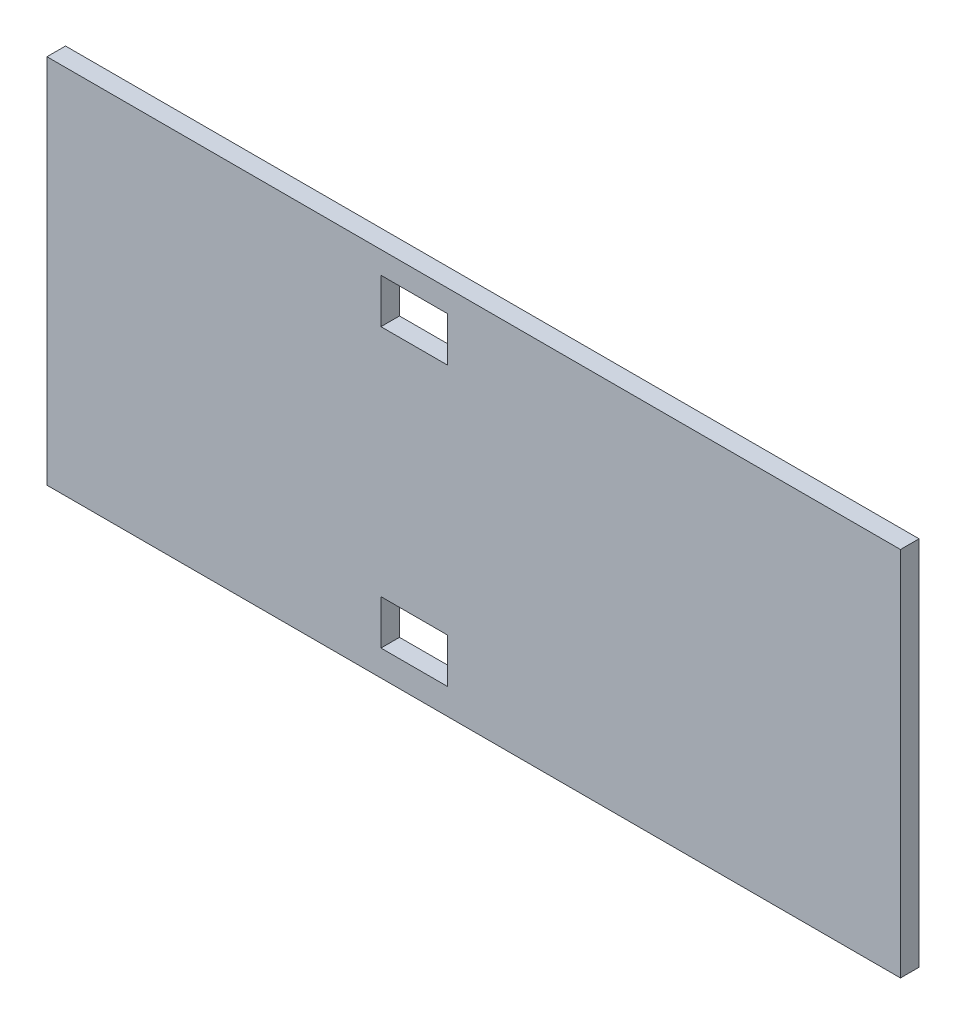
ISO-10303-21;
HEADER;
FILE_DESCRIPTION(('STEP AP214'),'2;1');
FILE_NAME('part.step','',(''),(''),'','','');
FILE_SCHEMA(('AUTOMOTIVE_DESIGN { 1 0 10303 214 1 1 1 1 }'));
ENDSEC;
DATA;
#1=APPLICATION_CONTEXT('core data for automotive mechanical design processes');
#2=APPLICATION_PROTOCOL_DEFINITION('international standard','automotive_design',2000,#1);
#3=PRODUCT_CONTEXT('',#1,'mechanical');
#4=PRODUCT('Part','Part','',(#3));
#5=PRODUCT_RELATED_PRODUCT_CATEGORY('part','',(#4));
#6=PRODUCT_DEFINITION_FORMATION('','',#4);
#7=PRODUCT_DEFINITION_CONTEXT('part definition',#1,'design');
#8=PRODUCT_DEFINITION('design','',#6,#7);
#9=PRODUCT_DEFINITION_SHAPE('','',#8);
#10=(LENGTH_UNIT() NAMED_UNIT(*) SI_UNIT(.MILLI.,.METRE.));
#11=(NAMED_UNIT(*) PLANE_ANGLE_UNIT() SI_UNIT($,.RADIAN.));
#12=(NAMED_UNIT(*) SI_UNIT($,.STERADIAN.) SOLID_ANGLE_UNIT());
#13=UNCERTAINTY_MEASURE_WITH_UNIT(LENGTH_MEASURE(1.E-05),#10,'distance_accuracy_value','');
#14=(GEOMETRIC_REPRESENTATION_CONTEXT(3) GLOBAL_UNCERTAINTY_ASSIGNED_CONTEXT((#13)) GLOBAL_UNIT_ASSIGNED_CONTEXT((#10,
#11,#12)) REPRESENTATION_CONTEXT('',''));
#15=CARTESIAN_POINT('',(0.,0.,0.));
#16=DIRECTION('',(0.,0.,1.));
#17=DIRECTION('',(1.,0.,0.));
#18=AXIS2_PLACEMENT_3D('',#15,#16,#17);
#19=CARTESIAN_POINT('',(0.,0.,6.35));
#20=DIRECTION('',(-1.,0.,0.));
#21=DIRECTION('',(0.,0.,1.));
#22=AXIS2_PLACEMENT_3D('',#19,#20,#21);
#23=PLANE('',#22);
#24=DIRECTION('',(0.,1.,0.));
#25=VECTOR('',#24,1.);
#26=CARTESIAN_POINT('',(0.,0.,0.));
#27=LINE('',#26,#25);
#28=CARTESIAN_POINT('',(0.,0.,0.));
#29=VERTEX_POINT('',#28);
#30=CARTESIAN_POINT('',(0.,127.,0.));
#31=VERTEX_POINT('',#30);
#32=EDGE_CURVE('E212',#29,#31,#27,.T.);
#33=ORIENTED_EDGE('',*,*,#32,.F.);
#34=DIRECTION('',(0.,0.,-1.));
#35=VECTOR('',#34,1.);
#36=CARTESIAN_POINT('',(0.,0.,6.35));
#37=LINE('',#36,#35);
#38=CARTESIAN_POINT('',(0.,0.,6.35));
#39=VERTEX_POINT('',#38);
#40=EDGE_CURVE('E11',#39,#29,#37,.T.);
#41=ORIENTED_EDGE('',*,*,#40,.F.);
#42=DIRECTION('',(0.,1.,0.));
#43=VECTOR('',#42,1.);
#44=CARTESIAN_POINT('',(0.,0.,6.35));
#45=LINE('',#44,#43);
#46=CARTESIAN_POINT('',(0.,127.,6.35));
#47=VERTEX_POINT('',#46);
#48=EDGE_CURVE('E222',#39,#47,#45,.T.);
#49=ORIENTED_EDGE('',*,*,#48,.T.);
#50=DIRECTION('',(0.,0.,-1.));
#51=VECTOR('',#50,1.);
#52=CARTESIAN_POINT('',(0.,127.,6.35));
#53=LINE('',#52,#51);
#54=EDGE_CURVE('E42',#47,#31,#53,.T.);
#55=ORIENTED_EDGE('',*,*,#54,.T.);
#56=EDGE_LOOP('',(#33,#41,#49,#55));
#57=FACE_BOUND('',#56,.T.);
#58=ADVANCED_FACE('F39',(#57),#23,.T.);
#59=CARTESIAN_POINT('',(0.,0.,6.35));
#60=DIRECTION('',(0.,1.,0.));
#61=DIRECTION('',(0.,0.,1.));
#62=AXIS2_PLACEMENT_3D('',#59,#60,#61);
#63=PLANE('',#62);
#64=DIRECTION('',(1.,0.,0.));
#65=VECTOR('',#64,1.);
#66=CARTESIAN_POINT('',(0.,0.,0.));
#67=LINE('',#66,#65);
#68=CARTESIAN_POINT('',(292.1,0.,0.));
#69=VERTEX_POINT('',#68);
#70=EDGE_CURVE('E227',#29,#69,#67,.T.);
#71=ORIENTED_EDGE('',*,*,#70,.T.);
#72=DIRECTION('',(0.,0.,-1.));
#73=VECTOR('',#72,1.);
#74=CARTESIAN_POINT('',(292.1,0.,6.35));
#75=LINE('',#74,#73);
#76=CARTESIAN_POINT('',(292.1,0.,6.35));
#77=VERTEX_POINT('',#76);
#78=EDGE_CURVE('E48',#77,#69,#75,.T.);
#79=ORIENTED_EDGE('',*,*,#78,.F.);
#80=DIRECTION('',(1.,0.,0.));
#81=VECTOR('',#80,1.);
#82=CARTESIAN_POINT('',(0.,0.,6.35));
#83=LINE('',#82,#81);
#84=EDGE_CURVE('E234',#39,#77,#83,.T.);
#85=ORIENTED_EDGE('',*,*,#84,.F.);
#86=ORIENTED_EDGE('',*,*,#40,.T.);
#87=EDGE_LOOP('',(#71,#79,#85,#86));
#88=FACE_BOUND('',#87,.T.);
#89=ADVANCED_FACE('F268',(#88),#63,.F.);
#90=CARTESIAN_POINT('',(292.1,0.,6.35));
#91=DIRECTION('',(-1.,0.,0.));
#92=DIRECTION('',(0.,0.,1.));
#93=AXIS2_PLACEMENT_3D('',#90,#91,#92);
#94=PLANE('',#93);
#95=DIRECTION('',(0.,1.,0.));
#96=VECTOR('',#95,1.);
#97=CARTESIAN_POINT('',(292.1,0.,0.));
#98=LINE('',#97,#96);
#99=CARTESIAN_POINT('',(292.1,127.,0.));
#100=VERTEX_POINT('',#99);
#101=EDGE_CURVE('E244',#69,#100,#98,.T.);
#102=ORIENTED_EDGE('',*,*,#101,.T.);
#103=DIRECTION('',(0.,0.,-1.));
#104=VECTOR('',#103,1.);
#105=CARTESIAN_POINT('',(292.1,127.,6.35));
#106=LINE('',#105,#104);
#107=CARTESIAN_POINT('',(292.1,127.,6.35));
#108=VERTEX_POINT('',#107);
#109=EDGE_CURVE('E252',#108,#100,#106,.T.);
#110=ORIENTED_EDGE('',*,*,#109,.F.);
#111=DIRECTION('',(0.,1.,0.));
#112=VECTOR('',#111,1.);
#113=CARTESIAN_POINT('',(292.1,0.,6.35));
#114=LINE('',#113,#112);
#115=EDGE_CURVE('E231',#77,#108,#114,.T.);
#116=ORIENTED_EDGE('',*,*,#115,.F.);
#117=ORIENTED_EDGE('',*,*,#78,.T.);
#118=EDGE_LOOP('',(#102,#110,#116,#117));
#119=FACE_BOUND('',#118,.T.);
#120=ADVANCED_FACE('F272',(#119),#94,.F.);
#121=CARTESIAN_POINT('',(0.,127.,6.35));
#122=DIRECTION('',(0.,1.,0.));
#123=DIRECTION('',(0.,0.,1.));
#124=AXIS2_PLACEMENT_3D('',#121,#122,#123);
#125=PLANE('',#124);
#126=DIRECTION('',(1.,0.,0.));
#127=VECTOR('',#126,1.);
#128=CARTESIAN_POINT('',(0.,127.,0.));
#129=LINE('',#128,#127);
#130=EDGE_CURVE('E240',#31,#100,#129,.T.);
#131=ORIENTED_EDGE('',*,*,#130,.F.);
#132=ORIENTED_EDGE('',*,*,#54,.F.);
#133=DIRECTION('',(1.,0.,0.));
#134=VECTOR('',#133,1.);
#135=CARTESIAN_POINT('',(0.,127.,6.35));
#136=LINE('',#135,#134);
#137=EDGE_CURVE('E226',#47,#108,#136,.T.);
#138=ORIENTED_EDGE('',*,*,#137,.T.);
#139=ORIENTED_EDGE('',*,*,#109,.T.);
#140=EDGE_LOOP('',(#131,#132,#138,#139));
#141=FACE_BOUND('',#140,.T.);
#142=ADVANCED_FACE('F262',(#141),#125,.T.);
#143=CARTESIAN_POINT('',(0.,0.,6.35));
#144=DIRECTION('',(0.,0.,-1.));
#145=DIRECTION('',(-1.,0.,0.));
#146=AXIS2_PLACEMENT_3D('',#143,#144,#145);
#147=PLANE('',#146);
#148=DIRECTION('',(1.,0.,0.));
#149=VECTOR('',#148,1.);
#150=CARTESIAN_POINT('',(114.3,104.14,6.35));
#151=LINE('',#150,#149);
#152=CARTESIAN_POINT('',(114.3,104.14,6.35));
#153=VERTEX_POINT('',#152);
#154=CARTESIAN_POINT('',(137.16,104.14,6.35));
#155=VERTEX_POINT('',#154);
#156=EDGE_CURVE('E163',#153,#155,#151,.T.);
#157=ORIENTED_EDGE('',*,*,#156,.F.);
#158=DIRECTION('',(0.,-1.,0.));
#159=VECTOR('',#158,1.);
#160=CARTESIAN_POINT('',(114.3,119.38,6.35));
#161=LINE('',#160,#159);
#162=CARTESIAN_POINT('',(114.3,119.38,6.35));
#163=VERTEX_POINT('',#162);
#164=EDGE_CURVE('E56',#163,#153,#161,.T.);
#165=ORIENTED_EDGE('',*,*,#164,.F.);
#166=DIRECTION('',(-1.,0.,0.));
#167=VECTOR('',#166,1.);
#168=CARTESIAN_POINT('',(114.3,119.38,6.35));
#169=LINE('',#168,#167);
#170=CARTESIAN_POINT('',(137.16,119.38,6.35));
#171=VERTEX_POINT('',#170);
#172=EDGE_CURVE('E150',#171,#163,#169,.T.);
#173=ORIENTED_EDGE('',*,*,#172,.F.);
#174=DIRECTION('',(0.,1.,0.));
#175=VECTOR('',#174,1.);
#176=CARTESIAN_POINT('',(137.16,119.38,6.35));
#177=LINE('',#176,#175);
#178=EDGE_CURVE('E154',#155,#171,#177,.T.);
#179=ORIENTED_EDGE('',*,*,#178,.F.);
#180=EDGE_LOOP('',(#157,#165,#173,#179));
#181=FACE_BOUND('',#180,.T.);
#182=DIRECTION('',(1.,0.,0.));
#183=VECTOR('',#182,1.);
#184=CARTESIAN_POINT('',(114.3,8.89,6.35));
#185=LINE('',#184,#183);
#186=CARTESIAN_POINT('',(114.3,8.89,6.35));
#187=VERTEX_POINT('',#186);
#188=CARTESIAN_POINT('',(137.16,8.89,6.35));
#189=VERTEX_POINT('',#188);
#190=EDGE_CURVE('E198',#187,#189,#185,.T.);
#191=ORIENTED_EDGE('',*,*,#190,.F.);
#192=DIRECTION('',(0.,-1.,0.));
#193=VECTOR('',#192,1.);
#194=CARTESIAN_POINT('',(114.3,24.13,6.35));
#195=LINE('',#194,#193);
#196=CARTESIAN_POINT('',(114.3,24.13,6.35));
#197=VERTEX_POINT('',#196);
#198=EDGE_CURVE('E172',#197,#187,#195,.T.);
#199=ORIENTED_EDGE('',*,*,#198,.F.);
#200=DIRECTION('',(-1.,0.,0.));
#201=VECTOR('',#200,1.);
#202=CARTESIAN_POINT('',(114.3,24.13,6.35));
#203=LINE('',#202,#201);
#204=CARTESIAN_POINT('',(137.16,24.13,6.35));
#205=VERTEX_POINT('',#204);
#206=EDGE_CURVE('E183',#205,#197,#203,.T.);
#207=ORIENTED_EDGE('',*,*,#206,.F.);
#208=DIRECTION('',(0.,1.,0.));
#209=VECTOR('',#208,1.);
#210=CARTESIAN_POINT('',(137.16,24.13,6.35));
#211=LINE('',#210,#209);
#212=EDGE_CURVE('E202',#189,#205,#211,.T.);
#213=ORIENTED_EDGE('',*,*,#212,.F.);
#214=EDGE_LOOP('',(#191,#199,#207,#213));
#215=FACE_BOUND('',#214,.T.);
#216=ORIENTED_EDGE('',*,*,#48,.F.);
#217=ORIENTED_EDGE('',*,*,#84,.T.);
#218=ORIENTED_EDGE('',*,*,#115,.T.);
#219=ORIENTED_EDGE('',*,*,#137,.F.);
#220=EDGE_LOOP('',(#216,#217,#218,#219));
#221=FACE_BOUND('',#220,.T.);
#222=ADVANCED_FACE('F274',(#181,#215,#221),#147,.F.);
#223=CARTESIAN_POINT('',(0.,0.,0.));
#224=DIRECTION('',(0.,0.,-1.));
#225=DIRECTION('',(-1.,0.,0.));
#226=AXIS2_PLACEMENT_3D('',#223,#224,#225);
#227=PLANE('',#226);
#228=DIRECTION('',(0.,-1.,0.));
#229=VECTOR('',#228,1.);
#230=CARTESIAN_POINT('',(114.3,119.38,0.));
#231=LINE('',#230,#229);
#232=CARTESIAN_POINT('',(114.3,119.38,0.));
#233=VERTEX_POINT('',#232);
#234=CARTESIAN_POINT('',(114.3,104.14,0.));
#235=VERTEX_POINT('',#234);
#236=EDGE_CURVE('E131',#233,#235,#231,.T.);
#237=ORIENTED_EDGE('',*,*,#236,.T.);
#238=DIRECTION('',(1.,0.,0.));
#239=VECTOR('',#238,1.);
#240=CARTESIAN_POINT('',(114.3,104.14,0.));
#241=LINE('',#240,#239);
#242=CARTESIAN_POINT('',(137.16,104.14,0.));
#243=VERTEX_POINT('',#242);
#244=EDGE_CURVE('E141',#235,#243,#241,.T.);
#245=ORIENTED_EDGE('',*,*,#244,.T.);
#246=DIRECTION('',(0.,1.,0.));
#247=VECTOR('',#246,1.);
#248=CARTESIAN_POINT('',(137.16,119.38,0.));
#249=LINE('',#248,#247);
#250=CARTESIAN_POINT('',(137.16,119.38,0.));
#251=VERTEX_POINT('',#250);
#252=EDGE_CURVE('E64',#243,#251,#249,.T.);
#253=ORIENTED_EDGE('',*,*,#252,.T.);
#254=DIRECTION('',(-1.,0.,0.));
#255=VECTOR('',#254,1.);
#256=CARTESIAN_POINT('',(114.3,119.38,0.));
#257=LINE('',#256,#255);
#258=EDGE_CURVE('E138',#251,#233,#257,.T.);
#259=ORIENTED_EDGE('',*,*,#258,.T.);
#260=EDGE_LOOP('',(#237,#245,#253,#259));
#261=FACE_BOUND('',#260,.T.);
#262=DIRECTION('',(0.,-1.,0.));
#263=VECTOR('',#262,1.);
#264=CARTESIAN_POINT('',(114.3,24.13,0.));
#265=LINE('',#264,#263);
#266=CARTESIAN_POINT('',(114.3,24.13,0.));
#267=VERTEX_POINT('',#266);
#268=CARTESIAN_POINT('',(114.3,8.89,0.));
#269=VERTEX_POINT('',#268);
#270=EDGE_CURVE('E178',#267,#269,#265,.T.);
#271=ORIENTED_EDGE('',*,*,#270,.T.);
#272=DIRECTION('',(1.,0.,0.));
#273=VECTOR('',#272,1.);
#274=CARTESIAN_POINT('',(114.3,8.89,0.));
#275=LINE('',#274,#273);
#276=CARTESIAN_POINT('',(137.16,8.89,0.));
#277=VERTEX_POINT('',#276);
#278=EDGE_CURVE('E182',#269,#277,#275,.T.);
#279=ORIENTED_EDGE('',*,*,#278,.T.);
#280=DIRECTION('',(0.,1.,0.));
#281=VECTOR('',#280,1.);
#282=CARTESIAN_POINT('',(137.16,24.13,0.));
#283=LINE('',#282,#281);
#284=CARTESIAN_POINT('',(137.16,24.13,0.));
#285=VERTEX_POINT('',#284);
#286=EDGE_CURVE('E187',#277,#285,#283,.T.);
#287=ORIENTED_EDGE('',*,*,#286,.T.);
#288=DIRECTION('',(-1.,0.,0.));
#289=VECTOR('',#288,1.);
#290=CARTESIAN_POINT('',(114.3,24.13,0.));
#291=LINE('',#290,#289);
#292=EDGE_CURVE('E191',#285,#267,#291,.T.);
#293=ORIENTED_EDGE('',*,*,#292,.T.);
#294=EDGE_LOOP('',(#271,#279,#287,#293));
#295=FACE_BOUND('',#294,.T.);
#296=ORIENTED_EDGE('',*,*,#32,.T.);
#297=ORIENTED_EDGE('',*,*,#130,.T.);
#298=ORIENTED_EDGE('',*,*,#101,.F.);
#299=ORIENTED_EDGE('',*,*,#70,.F.);
#300=EDGE_LOOP('',(#296,#297,#298,#299));
#301=FACE_BOUND('',#300,.T.);
#302=ADVANCED_FACE('F146',(#261,#295,#301),#227,.T.);
#303=CARTESIAN_POINT('',(114.3,24.13,0.));
#304=DIRECTION('',(-1.,0.,0.));
#305=DIRECTION('',(0.,0.,1.));
#306=AXIS2_PLACEMENT_3D('',#303,#304,#305);
#307=PLANE('',#306);
#308=ORIENTED_EDGE('',*,*,#198,.T.);
#309=DIRECTION('',(0.,0.,1.));
#310=VECTOR('',#309,1.);
#311=CARTESIAN_POINT('',(114.3,8.89,0.));
#312=LINE('',#311,#310);
#313=EDGE_CURVE('E195',#269,#187,#312,.T.);
#314=ORIENTED_EDGE('',*,*,#313,.F.);
#315=ORIENTED_EDGE('',*,*,#270,.F.);
#316=DIRECTION('',(0.,0.,1.));
#317=VECTOR('',#316,1.);
#318=CARTESIAN_POINT('',(114.3,24.13,0.));
#319=LINE('',#318,#317);
#320=EDGE_CURVE('E209',#267,#197,#319,.T.);
#321=ORIENTED_EDGE('',*,*,#320,.T.);
#322=EDGE_LOOP('',(#308,#314,#315,#321));
#323=FACE_BOUND('',#322,.T.);
#324=ADVANCED_FACE('F282',(#323),#307,.F.);
#325=CARTESIAN_POINT('',(114.3,24.13,0.));
#326=DIRECTION('',(0.,1.,0.));
#327=DIRECTION('',(0.,0.,1.));
#328=AXIS2_PLACEMENT_3D('',#325,#326,#327);
#329=PLANE('',#328);
#330=ORIENTED_EDGE('',*,*,#206,.T.);
#331=ORIENTED_EDGE('',*,*,#320,.F.);
#332=ORIENTED_EDGE('',*,*,#292,.F.);
#333=DIRECTION('',(0.,0.,1.));
#334=VECTOR('',#333,1.);
#335=CARTESIAN_POINT('',(137.16,24.13,0.));
#336=LINE('',#335,#334);
#337=EDGE_CURVE('E213',#285,#205,#336,.T.);
#338=ORIENTED_EDGE('',*,*,#337,.T.);
#339=EDGE_LOOP('',(#330,#331,#332,#338));
#340=FACE_BOUND('',#339,.T.);
#341=ADVANCED_FACE('F311',(#340),#329,.F.);
#342=CARTESIAN_POINT('',(137.16,24.13,0.));
#343=DIRECTION('',(1.,0.,0.));
#344=DIRECTION('',(0.,0.,-1.));
#345=AXIS2_PLACEMENT_3D('',#342,#343,#344);
#346=PLANE('',#345);
#347=ORIENTED_EDGE('',*,*,#212,.T.);
#348=ORIENTED_EDGE('',*,*,#337,.F.);
#349=ORIENTED_EDGE('',*,*,#286,.F.);
#350=DIRECTION('',(0.,0.,1.));
#351=VECTOR('',#350,1.);
#352=CARTESIAN_POINT('',(137.16,8.89,0.));
#353=LINE('',#352,#351);
#354=EDGE_CURVE('E216',#277,#189,#353,.T.);
#355=ORIENTED_EDGE('',*,*,#354,.T.);
#356=EDGE_LOOP('',(#347,#348,#349,#355));
#357=FACE_BOUND('',#356,.T.);
#358=ADVANCED_FACE('F321',(#357),#346,.F.);
#359=CARTESIAN_POINT('',(114.3,8.89,0.));
#360=DIRECTION('',(0.,-1.,0.));
#361=DIRECTION('',(0.,0.,-1.));
#362=AXIS2_PLACEMENT_3D('',#359,#360,#361);
#363=PLANE('',#362);
#364=ORIENTED_EDGE('',*,*,#190,.T.);
#365=ORIENTED_EDGE('',*,*,#354,.F.);
#366=ORIENTED_EDGE('',*,*,#278,.F.);
#367=ORIENTED_EDGE('',*,*,#313,.T.);
#368=EDGE_LOOP('',(#364,#365,#366,#367));
#369=FACE_BOUND('',#368,.T.);
#370=ADVANCED_FACE('F331',(#369),#363,.F.);
#371=CARTESIAN_POINT('',(114.3,119.38,0.));
#372=DIRECTION('',(-1.,0.,0.));
#373=DIRECTION('',(0.,0.,1.));
#374=AXIS2_PLACEMENT_3D('',#371,#372,#373);
#375=PLANE('',#374);
#376=ORIENTED_EDGE('',*,*,#164,.T.);
#377=DIRECTION('',(0.,0.,1.));
#378=VECTOR('',#377,1.);
#379=CARTESIAN_POINT('',(114.3,104.14,0.));
#380=LINE('',#379,#378);
#381=EDGE_CURVE('E127',#235,#153,#380,.T.);
#382=ORIENTED_EDGE('',*,*,#381,.F.);
#383=ORIENTED_EDGE('',*,*,#236,.F.);
#384=DIRECTION('',(0.,0.,1.));
#385=VECTOR('',#384,1.);
#386=CARTESIAN_POINT('',(114.3,119.38,0.));
#387=LINE('',#386,#385);
#388=EDGE_CURVE('E169',#233,#163,#387,.T.);
#389=ORIENTED_EDGE('',*,*,#388,.T.);
#390=EDGE_LOOP('',(#376,#382,#383,#389));
#391=FACE_BOUND('',#390,.T.);
#392=ADVANCED_FACE('F129',(#391),#375,.F.);
#393=CARTESIAN_POINT('',(114.3,119.38,0.));
#394=DIRECTION('',(0.,1.,0.));
#395=DIRECTION('',(0.,0.,1.));
#396=AXIS2_PLACEMENT_3D('',#393,#394,#395);
#397=PLANE('',#396);
#398=ORIENTED_EDGE('',*,*,#172,.T.);
#399=ORIENTED_EDGE('',*,*,#388,.F.);
#400=ORIENTED_EDGE('',*,*,#258,.F.);
#401=DIRECTION('',(0.,0.,1.));
#402=VECTOR('',#401,1.);
#403=CARTESIAN_POINT('',(137.16,119.38,0.));
#404=LINE('',#403,#402);
#405=EDGE_CURVE('E173',#251,#171,#404,.T.);
#406=ORIENTED_EDGE('',*,*,#405,.T.);
#407=EDGE_LOOP('',(#398,#399,#400,#406));
#408=FACE_BOUND('',#407,.T.);
#409=ADVANCED_FACE('F358',(#408),#397,.F.);
#410=CARTESIAN_POINT('',(137.16,119.38,0.));
#411=DIRECTION('',(1.,0.,0.));
#412=DIRECTION('',(0.,0.,-1.));
#413=AXIS2_PLACEMENT_3D('',#410,#411,#412);
#414=PLANE('',#413);
#415=ORIENTED_EDGE('',*,*,#178,.T.);
#416=ORIENTED_EDGE('',*,*,#405,.F.);
#417=ORIENTED_EDGE('',*,*,#252,.F.);
#418=DIRECTION('',(0.,0.,1.));
#419=VECTOR('',#418,1.);
#420=CARTESIAN_POINT('',(137.16,104.14,0.));
#421=LINE('',#420,#419);
#422=EDGE_CURVE('E137',#243,#155,#421,.T.);
#423=ORIENTED_EDGE('',*,*,#422,.T.);
#424=EDGE_LOOP('',(#415,#416,#417,#423));
#425=FACE_BOUND('',#424,.T.);
#426=ADVANCED_FACE('F367',(#425),#414,.F.);
#427=CARTESIAN_POINT('',(114.3,104.14,0.));
#428=DIRECTION('',(0.,-1.,0.));
#429=DIRECTION('',(0.,0.,-1.));
#430=AXIS2_PLACEMENT_3D('',#427,#428,#429);
#431=PLANE('',#430);
#432=ORIENTED_EDGE('',*,*,#156,.T.);
#433=ORIENTED_EDGE('',*,*,#422,.F.);
#434=ORIENTED_EDGE('',*,*,#244,.F.);
#435=ORIENTED_EDGE('',*,*,#381,.T.);
#436=EDGE_LOOP('',(#432,#433,#434,#435));
#437=FACE_BOUND('',#436,.T.);
#438=ADVANCED_FACE('F142',(#437),#431,.F.);
#439=CLOSED_SHELL('',(#58,#89,#120,#142,#222,#302,#324,#341,#358,#370,#392,#409,#426,#438));
#440=MANIFOLD_SOLID_BREP('B2',#439);
#441=ADVANCED_BREP_SHAPE_REPRESENTATION('',(#18,#440),#14);
#442=SHAPE_DEFINITION_REPRESENTATION(#9,#441);
ENDSEC;
END-ISO-10303-21;
